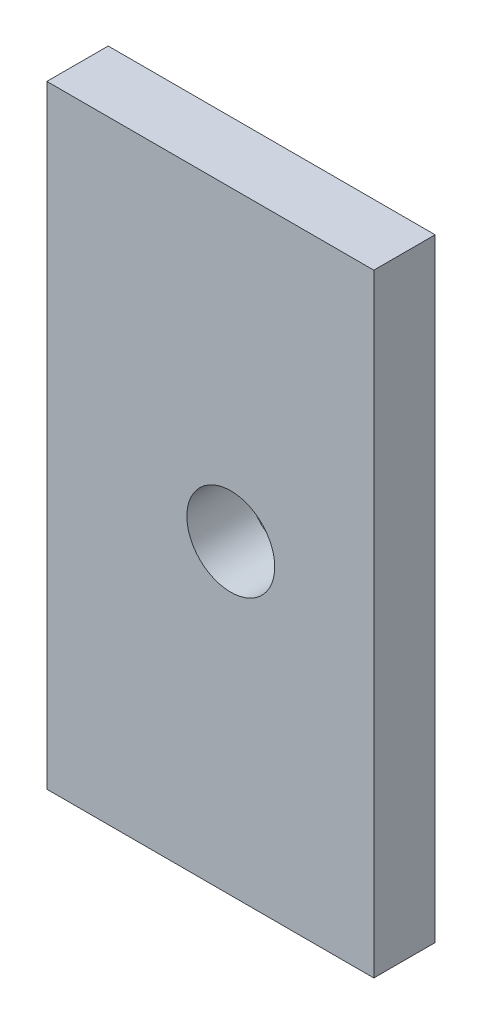
ISO-10303-21;
HEADER;
FILE_DESCRIPTION(('STEP AP214'),'2;1');
FILE_NAME('part.step','',(''),(''),'','','');
FILE_SCHEMA(('AUTOMOTIVE_DESIGN { 1 0 10303 214 1 1 1 1 }'));
ENDSEC;
DATA;
#1=APPLICATION_CONTEXT('core data for automotive mechanical design processes');
#2=APPLICATION_PROTOCOL_DEFINITION('international standard','automotive_design',2000,#1);
#3=PRODUCT_CONTEXT('',#1,'mechanical');
#4=PRODUCT('Part','Part','',(#3));
#5=PRODUCT_RELATED_PRODUCT_CATEGORY('part','',(#4));
#6=PRODUCT_DEFINITION_FORMATION('','',#4);
#7=PRODUCT_DEFINITION_CONTEXT('part definition',#1,'design');
#8=PRODUCT_DEFINITION('design','',#6,#7);
#9=PRODUCT_DEFINITION_SHAPE('','',#8);
#10=(LENGTH_UNIT() NAMED_UNIT(*) SI_UNIT(.MILLI.,.METRE.));
#11=(NAMED_UNIT(*) PLANE_ANGLE_UNIT() SI_UNIT($,.RADIAN.));
#12=(NAMED_UNIT(*) SI_UNIT($,.STERADIAN.) SOLID_ANGLE_UNIT());
#13=UNCERTAINTY_MEASURE_WITH_UNIT(LENGTH_MEASURE(1.E-05),#10,'distance_accuracy_value','');
#14=(GEOMETRIC_REPRESENTATION_CONTEXT(3) GLOBAL_UNCERTAINTY_ASSIGNED_CONTEXT((#13)) GLOBAL_UNIT_ASSIGNED_CONTEXT((#10,
#11,#12)) REPRESENTATION_CONTEXT('',''));
#15=CARTESIAN_POINT('',(0.,0.,0.));
#16=DIRECTION('',(0.,0.,1.));
#17=DIRECTION('',(1.,0.,0.));
#18=AXIS2_PLACEMENT_3D('',#15,#16,#17);
#19=CARTESIAN_POINT('',(0.,0.,3.));
#20=DIRECTION('',(-1.,0.,0.));
#21=DIRECTION('',(0.,0.,1.));
#22=AXIS2_PLACEMENT_3D('',#19,#20,#21);
#23=PLANE('',#22);
#24=DIRECTION('',(0.,1.,0.));
#25=VECTOR('',#24,1.);
#26=CARTESIAN_POINT('',(0.,0.,0.));
#27=LINE('',#26,#25);
#28=CARTESIAN_POINT('',(0.,0.,0.));
#29=VERTEX_POINT('',#28);
#30=CARTESIAN_POINT('',(0.,30.,0.));
#31=VERTEX_POINT('',#30);
#32=EDGE_CURVE('E97',#29,#31,#27,.T.);
#33=ORIENTED_EDGE('',*,*,#32,.T.);
#34=DIRECTION('',(0.,0.,-1.));
#35=VECTOR('',#34,1.);
#36=CARTESIAN_POINT('',(0.,30.,3.));
#37=LINE('',#36,#35);
#38=CARTESIAN_POINT('',(0.,30.,3.));
#39=VERTEX_POINT('',#38);
#40=EDGE_CURVE('E11',#39,#31,#37,.T.);
#41=ORIENTED_EDGE('',*,*,#40,.F.);
#42=DIRECTION('',(0.,1.,0.));
#43=VECTOR('',#42,1.);
#44=CARTESIAN_POINT('',(0.,0.,3.));
#45=LINE('',#44,#43);
#46=CARTESIAN_POINT('',(0.,0.,3.));
#47=VERTEX_POINT('',#46);
#48=EDGE_CURVE('E85',#47,#39,#45,.T.);
#49=ORIENTED_EDGE('',*,*,#48,.F.);
#50=DIRECTION('',(0.,0.,-1.));
#51=VECTOR('',#50,1.);
#52=CARTESIAN_POINT('',(0.,0.,3.));
#53=LINE('',#52,#51);
#54=EDGE_CURVE('E93',#47,#29,#53,.T.);
#55=ORIENTED_EDGE('',*,*,#54,.T.);
#56=EDGE_LOOP('',(#33,#41,#49,#55));
#57=FACE_BOUND('',#56,.T.);
#58=ADVANCED_FACE('F34',(#57),#23,.F.);
#59=CARTESIAN_POINT('',(0.,30.,3.));
#60=DIRECTION('',(0.,-1.,0.));
#61=DIRECTION('',(1.,0.,0.));
#62=AXIS2_PLACEMENT_3D('',#59,#60,#61);
#63=PLANE('',#62);
#64=DIRECTION('',(-1.,0.,0.));
#65=VECTOR('',#64,1.);
#66=CARTESIAN_POINT('',(0.,30.,0.));
#67=LINE('',#66,#65);
#68=CARTESIAN_POINT('',(-16.,30.,0.));
#69=VERTEX_POINT('',#68);
#70=EDGE_CURVE('E89',#31,#69,#67,.T.);
#71=ORIENTED_EDGE('',*,*,#70,.T.);
#72=DIRECTION('',(0.,0.,-1.));
#73=VECTOR('',#72,1.);
#74=CARTESIAN_POINT('',(-16.,30.,3.));
#75=LINE('',#74,#73);
#76=CARTESIAN_POINT('',(-16.,30.,3.));
#77=VERTEX_POINT('',#76);
#78=EDGE_CURVE('E42',#77,#69,#75,.T.);
#79=ORIENTED_EDGE('',*,*,#78,.F.);
#80=DIRECTION('',(-1.,0.,0.));
#81=VECTOR('',#80,1.);
#82=CARTESIAN_POINT('',(0.,30.,3.));
#83=LINE('',#82,#81);
#84=EDGE_CURVE('E80',#39,#77,#83,.T.);
#85=ORIENTED_EDGE('',*,*,#84,.F.);
#86=ORIENTED_EDGE('',*,*,#40,.T.);
#87=EDGE_LOOP('',(#71,#79,#85,#86));
#88=FACE_BOUND('',#87,.T.);
#89=ADVANCED_FACE('F88',(#88),#63,.F.);
#90=CARTESIAN_POINT('',(-16.,0.,3.));
#91=DIRECTION('',(1.,0.,0.));
#92=DIRECTION('',(0.,0.,-1.));
#93=AXIS2_PLACEMENT_3D('',#90,#91,#92);
#94=PLANE('',#93);
#95=DIRECTION('',(0.,-1.,0.));
#96=VECTOR('',#95,1.);
#97=CARTESIAN_POINT('',(-16.,0.,0.));
#98=LINE('',#97,#96);
#99=CARTESIAN_POINT('',(-16.,0.,0.));
#100=VERTEX_POINT('',#99);
#101=EDGE_CURVE('E67',#69,#100,#98,.T.);
#102=ORIENTED_EDGE('',*,*,#101,.T.);
#103=DIRECTION('',(0.,0.,-1.));
#104=VECTOR('',#103,1.);
#105=CARTESIAN_POINT('',(-16.,0.,3.));
#106=LINE('',#105,#104);
#107=CARTESIAN_POINT('',(-16.,0.,3.));
#108=VERTEX_POINT('',#107);
#109=EDGE_CURVE('E90',#108,#100,#106,.T.);
#110=ORIENTED_EDGE('',*,*,#109,.F.);
#111=DIRECTION('',(0.,-1.,0.));
#112=VECTOR('',#111,1.);
#113=CARTESIAN_POINT('',(-16.,0.,3.));
#114=LINE('',#113,#112);
#115=EDGE_CURVE('E83',#77,#108,#114,.T.);
#116=ORIENTED_EDGE('',*,*,#115,.F.);
#117=ORIENTED_EDGE('',*,*,#78,.T.);
#118=EDGE_LOOP('',(#102,#110,#116,#117));
#119=FACE_BOUND('',#118,.T.);
#120=ADVANCED_FACE('F91',(#119),#94,.F.);
#121=CARTESIAN_POINT('',(0.,0.,3.));
#122=DIRECTION('',(0.,1.,0.));
#123=DIRECTION('',(-1.,0.,0.));
#124=AXIS2_PLACEMENT_3D('',#121,#122,#123);
#125=PLANE('',#124);
#126=DIRECTION('',(1.,0.,0.));
#127=VECTOR('',#126,1.);
#128=CARTESIAN_POINT('',(0.,0.,0.));
#129=LINE('',#128,#127);
#130=EDGE_CURVE('E73',#100,#29,#129,.T.);
#131=ORIENTED_EDGE('',*,*,#130,.T.);
#132=ORIENTED_EDGE('',*,*,#54,.F.);
#133=DIRECTION('',(1.,0.,0.));
#134=VECTOR('',#133,1.);
#135=CARTESIAN_POINT('',(0.,0.,3.));
#136=LINE('',#135,#134);
#137=EDGE_CURVE('E50',#108,#47,#136,.T.);
#138=ORIENTED_EDGE('',*,*,#137,.F.);
#139=ORIENTED_EDGE('',*,*,#109,.T.);
#140=EDGE_LOOP('',(#131,#132,#138,#139));
#141=FACE_BOUND('',#140,.T.);
#142=ADVANCED_FACE('F105',(#141),#125,.F.);
#143=CARTESIAN_POINT('',(0.,0.,3.));
#144=DIRECTION('',(0.,0.,1.));
#145=DIRECTION('',(1.,0.,0.));
#146=AXIS2_PLACEMENT_3D('',#143,#144,#145);
#147=PLANE('',#146);
#148=CARTESIAN_POINT('',(-7.,15.,3.));
#149=DIRECTION('',(0.,0.,1.));
#150=DIRECTION('',(1.,0.,0.));
#151=AXIS2_PLACEMENT_3D('',#148,#149,#150);
#152=CIRCLE('',#151,2.14999999999999);
#153=CARTESIAN_POINT('',(-4.85000000000001,15.,3.));
#154=VERTEX_POINT('',#153);
#155=EDGE_CURVE('E113',#154,#154,#152,.T.);
#156=ORIENTED_EDGE('',*,*,#155,.F.);
#157=EDGE_LOOP('',(#156));
#158=FACE_BOUND('',#157,.T.);
#159=ORIENTED_EDGE('',*,*,#48,.T.);
#160=ORIENTED_EDGE('',*,*,#84,.T.);
#161=ORIENTED_EDGE('',*,*,#115,.T.);
#162=ORIENTED_EDGE('',*,*,#137,.T.);
#163=EDGE_LOOP('',(#159,#160,#161,#162));
#164=FACE_BOUND('',#163,.T.);
#165=ADVANCED_FACE('F81',(#158,#164),#147,.T.);
#166=CARTESIAN_POINT('',(0.,0.,0.));
#167=DIRECTION('',(0.,0.,1.));
#168=DIRECTION('',(1.,0.,0.));
#169=AXIS2_PLACEMENT_3D('',#166,#167,#168);
#170=PLANE('',#169);
#171=CARTESIAN_POINT('',(-7.,15.,0.));
#172=DIRECTION('',(0.,0.,1.));
#173=DIRECTION('',(1.,0.,0.));
#174=AXIS2_PLACEMENT_3D('',#171,#172,#173);
#175=CIRCLE('',#174,2.14999999999998);
#176=CARTESIAN_POINT('',(-4.85000000000002,15.,0.));
#177=VERTEX_POINT('',#176);
#178=EDGE_CURVE('E100',#177,#177,#175,.T.);
#179=ORIENTED_EDGE('',*,*,#178,.T.);
#180=EDGE_LOOP('',(#179));
#181=FACE_BOUND('',#180,.T.);
#182=ORIENTED_EDGE('',*,*,#32,.F.);
#183=ORIENTED_EDGE('',*,*,#130,.F.);
#184=ORIENTED_EDGE('',*,*,#101,.F.);
#185=ORIENTED_EDGE('',*,*,#70,.F.);
#186=EDGE_LOOP('',(#182,#183,#184,#185));
#187=FACE_BOUND('',#186,.T.);
#188=ADVANCED_FACE('F108',(#181,#187),#170,.F.);
#189=CARTESIAN_POINT('',(-7.,15.,3.));
#190=DIRECTION('',(0.,0.,1.));
#191=DIRECTION('',(1.,0.,0.));
#192=AXIS2_PLACEMENT_3D('',#189,#190,#191);
#193=CYLINDRICAL_SURFACE('',#192,2.14999999999998);
#194=ORIENTED_EDGE('',*,*,#155,.T.);
#195=EDGE_LOOP('',(#194));
#196=FACE_BOUND('',#195,.T.);
#197=ORIENTED_EDGE('',*,*,#178,.F.);
#198=EDGE_LOOP('',(#197));
#199=FACE_BOUND('',#198,.T.);
#200=ADVANCED_FACE('F117',(#196,#199),#193,.F.);
#201=CLOSED_SHELL('',(#58,#89,#120,#142,#165,#188,#200));
#202=MANIFOLD_SOLID_BREP('B2',#201);
#203=ADVANCED_BREP_SHAPE_REPRESENTATION('',(#18,#202),#14);
#204=SHAPE_DEFINITION_REPRESENTATION(#9,#203);
ENDSEC;
END-ISO-10303-21;
